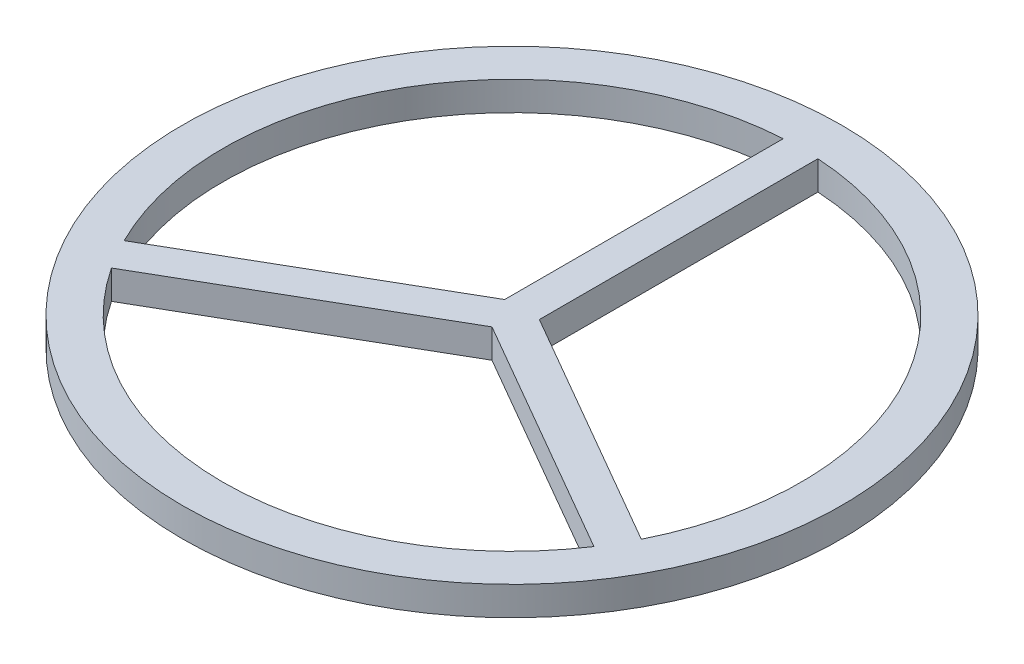
ISO-10303-21;
HEADER;
FILE_DESCRIPTION(('STEP AP214'),'2;1');
FILE_NAME('part.step','',(''),(''),'','','');
FILE_SCHEMA(('AUTOMOTIVE_DESIGN { 1 0 10303 214 1 1 1 1 }'));
ENDSEC;
DATA;
#1=APPLICATION_CONTEXT('core data for automotive mechanical design processes');
#2=APPLICATION_PROTOCOL_DEFINITION('international standard','automotive_design',2000,#1);
#3=PRODUCT_CONTEXT('',#1,'mechanical');
#4=PRODUCT('Part','Part','',(#3));
#5=PRODUCT_RELATED_PRODUCT_CATEGORY('part','',(#4));
#6=PRODUCT_DEFINITION_FORMATION('','',#4);
#7=PRODUCT_DEFINITION_CONTEXT('part definition',#1,'design');
#8=PRODUCT_DEFINITION('design','',#6,#7);
#9=PRODUCT_DEFINITION_SHAPE('','',#8);
#10=(LENGTH_UNIT() NAMED_UNIT(*) SI_UNIT(.MILLI.,.METRE.));
#11=(NAMED_UNIT(*) PLANE_ANGLE_UNIT() SI_UNIT($,.RADIAN.));
#12=(NAMED_UNIT(*) SI_UNIT($,.STERADIAN.) SOLID_ANGLE_UNIT());
#13=UNCERTAINTY_MEASURE_WITH_UNIT(LENGTH_MEASURE(1.E-05),#10,'distance_accuracy_value','');
#14=(GEOMETRIC_REPRESENTATION_CONTEXT(3) GLOBAL_UNCERTAINTY_ASSIGNED_CONTEXT((#13)) GLOBAL_UNIT_ASSIGNED_CONTEXT((#10,
#11,#12)) REPRESENTATION_CONTEXT('',''));
#15=CARTESIAN_POINT('',(0.,0.,0.));
#16=DIRECTION('',(0.,0.,1.));
#17=DIRECTION('',(1.,0.,0.));
#18=AXIS2_PLACEMENT_3D('',#15,#16,#17);
#19=CARTESIAN_POINT('',(0.,2.5,0.));
#20=DIRECTION('',(0.,-1.,0.));
#21=DIRECTION('',(0.,0.,-1.));
#22=AXIS2_PLACEMENT_3D('',#19,#20,#21);
#23=CYLINDRICAL_SURFACE('',#22,25.);
#24=DIRECTION('',(0.,-1.,0.));
#25=VECTOR('',#24,1.);
#26=CARTESIAN_POINT('',(-22.3616288141361,2.5,11.1784416077912));
#27=LINE('',#26,#25);
#28=CARTESIAN_POINT('',(-22.3616288141361,0.,11.1784416077912));
#29=VERTEX_POINT('',#28);
#30=CARTESIAN_POINT('',(-22.3616288141361,2.5,11.1784416077912));
#31=VERTEX_POINT('',#30);
#32=EDGE_CURVE('E11',#29,#31,#27,.F.);
#33=ORIENTED_EDGE('',*,*,#32,.F.);
#34=CARTESIAN_POINT('',(0.,0.,0.));
#35=DIRECTION('',(0.,1.,0.));
#36=DIRECTION('',(0.,0.,1.));
#37=AXIS2_PLACEMENT_3D('',#34,#35,#36);
#38=CIRCLE('',#37,25.);
#39=CARTESIAN_POINT('',(-1.5,0.,-24.9549594269356));
#40=VERTEX_POINT('',#39);
#41=EDGE_CURVE('E153',#40,#29,#38,.T.);
#42=ORIENTED_EDGE('',*,*,#41,.F.);
#43=DIRECTION('',(0.,-1.,0.));
#44=VECTOR('',#43,1.);
#45=CARTESIAN_POINT('',(-1.5,2.5,-24.9549594269356));
#46=LINE('',#45,#44);
#47=CARTESIAN_POINT('',(-1.5,2.5,-24.9549594269356));
#48=VERTEX_POINT('',#47);
#49=EDGE_CURVE('E42',#48,#40,#46,.T.);
#50=ORIENTED_EDGE('',*,*,#49,.F.);
#51=CARTESIAN_POINT('',(0.,2.5,0.));
#52=DIRECTION('',(0.,1.,0.));
#53=DIRECTION('',(0.,0.,1.));
#54=AXIS2_PLACEMENT_3D('',#51,#52,#53);
#55=CIRCLE('',#54,25.);
#56=EDGE_CURVE('E149',#48,#31,#55,.T.);
#57=ORIENTED_EDGE('',*,*,#56,.T.);
#58=EDGE_LOOP('',(#33,#42,#50,#57));
#59=FACE_BOUND('',#58,.T.);
#60=ADVANCED_FACE('F34',(#59),#23,.F.);
#61=DIRECTION('',(0.,-1.,0.));
#62=VECTOR('',#61,1.);
#63=CARTESIAN_POINT('',(1.5,2.5,-24.9549594269356));
#64=LINE('',#63,#62);
#65=CARTESIAN_POINT('',(1.5,0.,-24.9549594269356));
#66=VERTEX_POINT('',#65);
#67=CARTESIAN_POINT('',(1.5,2.5,-24.9549594269356));
#68=VERTEX_POINT('',#67);
#69=EDGE_CURVE('E166',#66,#68,#64,.F.);
#70=ORIENTED_EDGE('',*,*,#69,.F.);
#71=CARTESIAN_POINT('',(22.3616288141361,0.,11.1784416077912));
#72=VERTEX_POINT('',#71);
#73=EDGE_CURVE('E150',#72,#66,#38,.T.);
#74=ORIENTED_EDGE('',*,*,#73,.F.);
#75=DIRECTION('',(0.,-1.,0.));
#76=VECTOR('',#75,1.);
#77=CARTESIAN_POINT('',(22.3616288141361,2.5,11.1784416077912));
#78=LINE('',#77,#76);
#79=CARTESIAN_POINT('',(22.3616288141361,2.5,11.1784416077912));
#80=VERTEX_POINT('',#79);
#81=EDGE_CURVE('E163',#80,#72,#78,.T.);
#82=ORIENTED_EDGE('',*,*,#81,.F.);
#83=EDGE_CURVE('E151',#80,#68,#55,.T.);
#84=ORIENTED_EDGE('',*,*,#83,.T.);
#85=EDGE_LOOP('',(#70,#74,#82,#84));
#86=FACE_BOUND('',#85,.T.);
#87=ADVANCED_FACE('F187',(#86),#23,.F.);
#88=CARTESIAN_POINT('',(0.,2.5,0.));
#89=DIRECTION('',(0.,1.,0.));
#90=DIRECTION('',(0.,0.,1.));
#91=AXIS2_PLACEMENT_3D('',#88,#89,#90);
#92=PLANE('',#91);
#93=ORIENTED_EDGE('',*,*,#56,.F.);
#94=DIRECTION('',(0.,0.,1.));
#95=VECTOR('',#94,1.);
#96=CARTESIAN_POINT('',(-1.5,2.5,-0.866025403784434));
#97=LINE('',#96,#95);
#98=CARTESIAN_POINT('',(-1.5,2.5,-0.866025403784434));
#99=VERTEX_POINT('',#98);
#100=EDGE_CURVE('E135',#48,#99,#97,.T.);
#101=ORIENTED_EDGE('',*,*,#100,.T.);
#102=DIRECTION('',(-0.866025403784436,0.,0.500000000000004));
#103=VECTOR('',#102,1.);
#104=CARTESIAN_POINT('',(-1.5,2.5,-0.866025403784434));
#105=LINE('',#104,#103);
#106=EDGE_CURVE('E122',#99,#31,#105,.T.);
#107=ORIENTED_EDGE('',*,*,#106,.T.);
#108=EDGE_LOOP('',(#93,#101,#107));
#109=FACE_BOUND('',#108,.T.);
#110=ORIENTED_EDGE('',*,*,#83,.F.);
#111=DIRECTION('',(-0.866025403784436,0.,-0.500000000000004));
#112=VECTOR('',#111,1.);
#113=CARTESIAN_POINT('',(1.5,2.5,-0.866025403784434));
#114=LINE('',#113,#112);
#115=CARTESIAN_POINT('',(1.5,2.5,-0.866025403784434));
#116=VERTEX_POINT('',#115);
#117=EDGE_CURVE('E127',#80,#116,#114,.T.);
#118=ORIENTED_EDGE('',*,*,#117,.T.);
#119=DIRECTION('',(0.,0.,-1.));
#120=VECTOR('',#119,1.);
#121=CARTESIAN_POINT('',(1.5,2.5,-0.866025403784434));
#122=LINE('',#121,#120);
#123=EDGE_CURVE('E129',#116,#68,#122,.T.);
#124=ORIENTED_EDGE('',*,*,#123,.T.);
#125=EDGE_LOOP('',(#110,#118,#124));
#126=FACE_BOUND('',#125,.T.);
#127=DIRECTION('',(0.866025403784436,0.,0.500000000000004));
#128=VECTOR('',#127,1.);
#129=CARTESIAN_POINT('',(0.,2.5,1.73205080756888));
#130=LINE('',#129,#128);
#131=CARTESIAN_POINT('',(0.,2.5,1.73205080756888));
#132=VERTEX_POINT('',#131);
#133=CARTESIAN_POINT('',(20.8616288141361,2.5,13.7765178191445));
#134=VERTEX_POINT('',#133);
#135=EDGE_CURVE('E111',#132,#134,#130,.T.);
#136=ORIENTED_EDGE('',*,*,#135,.T.);
#137=CARTESIAN_POINT('',(-20.8616288141361,2.5,13.7765178191445));
#138=VERTEX_POINT('',#137);
#139=EDGE_CURVE('E113',#138,#134,#55,.T.);
#140=ORIENTED_EDGE('',*,*,#139,.F.);
#141=DIRECTION('',(0.866025403784436,0.,-0.500000000000004));
#142=VECTOR('',#141,1.);
#143=CARTESIAN_POINT('',(0.,2.5,1.73205080756888));
#144=LINE('',#143,#142);
#145=EDGE_CURVE('E106',#138,#132,#144,.T.);
#146=ORIENTED_EDGE('',*,*,#145,.T.);
#147=EDGE_LOOP('',(#136,#140,#146));
#148=FACE_BOUND('',#147,.T.);
#149=CARTESIAN_POINT('',(0.,2.5,0.));
#150=DIRECTION('',(0.,1.,0.));
#151=DIRECTION('',(0.,0.,1.));
#152=AXIS2_PLACEMENT_3D('',#149,#150,#151);
#153=CIRCLE('',#152,28.5);
#154=CARTESIAN_POINT('',(0.,2.5,28.5));
#155=VERTEX_POINT('',#154);
#156=EDGE_CURVE('E154',#155,#155,#153,.T.);
#157=ORIENTED_EDGE('',*,*,#156,.T.);
#158=EDGE_LOOP('',(#157));
#159=FACE_BOUND('',#158,.T.);
#160=ADVANCED_FACE('F108',(#109,#126,#148,#159),#92,.T.);
#161=CARTESIAN_POINT('',(0.,0.,0.));
#162=DIRECTION('',(0.,1.,0.));
#163=DIRECTION('',(0.,0.,1.));
#164=AXIS2_PLACEMENT_3D('',#161,#162,#163);
#165=PLANE('',#164);
#166=DIRECTION('',(0.,0.,-1.));
#167=VECTOR('',#166,1.);
#168=CARTESIAN_POINT('',(-1.5,0.,-0.866025403784434));
#169=LINE('',#168,#167);
#170=CARTESIAN_POINT('',(-1.5,0.,-0.866025403784434));
#171=VERTEX_POINT('',#170);
#172=EDGE_CURVE('E57',#171,#40,#169,.T.);
#173=ORIENTED_EDGE('',*,*,#172,.T.);
#174=ORIENTED_EDGE('',*,*,#41,.T.);
#175=DIRECTION('',(0.866025403784436,0.,-0.500000000000004));
#176=VECTOR('',#175,1.);
#177=CARTESIAN_POINT('',(-1.5,0.,-0.866025403784434));
#178=LINE('',#177,#176);
#179=EDGE_CURVE('E147',#29,#171,#178,.T.);
#180=ORIENTED_EDGE('',*,*,#179,.T.);
#181=EDGE_LOOP('',(#173,#174,#180));
#182=FACE_BOUND('',#181,.T.);
#183=DIRECTION('',(0.866025403784436,0.,0.500000000000004));
#184=VECTOR('',#183,1.);
#185=CARTESIAN_POINT('',(1.5,0.,-0.866025403784434));
#186=LINE('',#185,#184);
#187=CARTESIAN_POINT('',(1.5,0.,-0.866025403784434));
#188=VERTEX_POINT('',#187);
#189=EDGE_CURVE('E183',#188,#72,#186,.T.);
#190=ORIENTED_EDGE('',*,*,#189,.T.);
#191=ORIENTED_EDGE('',*,*,#73,.T.);
#192=DIRECTION('',(0.,0.,1.));
#193=VECTOR('',#192,1.);
#194=CARTESIAN_POINT('',(1.5,0.,-0.866025403784434));
#195=LINE('',#194,#193);
#196=EDGE_CURVE('E181',#66,#188,#195,.T.);
#197=ORIENTED_EDGE('',*,*,#196,.T.);
#198=EDGE_LOOP('',(#190,#191,#197));
#199=FACE_BOUND('',#198,.T.);
#200=CARTESIAN_POINT('',(0.,0.,0.));
#201=DIRECTION('',(0.,1.,0.));
#202=DIRECTION('',(0.,0.,1.));
#203=AXIS2_PLACEMENT_3D('',#200,#201,#202);
#204=CIRCLE('',#203,28.5);
#205=CARTESIAN_POINT('',(0.,0.,28.5));
#206=VERTEX_POINT('',#205);
#207=EDGE_CURVE('E158',#206,#206,#204,.T.);
#208=ORIENTED_EDGE('',*,*,#207,.F.);
#209=EDGE_LOOP('',(#208));
#210=FACE_BOUND('',#209,.T.);
#211=CARTESIAN_POINT('',(-20.8616288141361,0.,13.7765178191445));
#212=VERTEX_POINT('',#211);
#213=CARTESIAN_POINT('',(20.8616288141361,0.,13.7765178191445));
#214=VERTEX_POINT('',#213);
#215=EDGE_CURVE('E146',#212,#214,#38,.T.);
#216=ORIENTED_EDGE('',*,*,#215,.T.);
#217=DIRECTION('',(-0.866025403784436,0.,-0.500000000000004));
#218=VECTOR('',#217,1.);
#219=CARTESIAN_POINT('',(0.,0.,1.73205080756888));
#220=LINE('',#219,#218);
#221=CARTESIAN_POINT('',(0.,0.,1.73205080756888));
#222=VERTEX_POINT('',#221);
#223=EDGE_CURVE('E142',#214,#222,#220,.T.);
#224=ORIENTED_EDGE('',*,*,#223,.T.);
#225=DIRECTION('',(-0.866025403784436,0.,0.500000000000004));
#226=VECTOR('',#225,1.);
#227=CARTESIAN_POINT('',(0.,0.,1.73205080756888));
#228=LINE('',#227,#226);
#229=EDGE_CURVE('E49',#222,#212,#228,.T.);
#230=ORIENTED_EDGE('',*,*,#229,.T.);
#231=EDGE_LOOP('',(#216,#224,#230));
#232=FACE_BOUND('',#231,.T.);
#233=ADVANCED_FACE('F179',(#182,#199,#210,#232),#165,.F.);
#234=CARTESIAN_POINT('',(0.,2.5,0.));
#235=DIRECTION('',(0.,-1.,0.));
#236=DIRECTION('',(0.,0.,-1.));
#237=AXIS2_PLACEMENT_3D('',#234,#235,#236);
#238=CYLINDRICAL_SURFACE('',#237,28.5);
#239=ORIENTED_EDGE('',*,*,#156,.F.);
#240=EDGE_LOOP('',(#239));
#241=FACE_BOUND('',#240,.T.);
#242=ORIENTED_EDGE('',*,*,#207,.T.);
#243=EDGE_LOOP('',(#242));
#244=FACE_BOUND('',#243,.T.);
#245=ADVANCED_FACE('F36',(#241,#244),#238,.T.);
#246=DIRECTION('',(0.,-1.,0.));
#247=VECTOR('',#246,1.);
#248=CARTESIAN_POINT('',(20.8616288141361,2.5,13.7765178191445));
#249=LINE('',#248,#247);
#250=EDGE_CURVE('E126',#214,#134,#249,.F.);
#251=ORIENTED_EDGE('',*,*,#250,.F.);
#252=ORIENTED_EDGE('',*,*,#215,.F.);
#253=DIRECTION('',(0.,-1.,0.));
#254=VECTOR('',#253,1.);
#255=CARTESIAN_POINT('',(-20.8616288141361,2.5,13.7765178191445));
#256=LINE('',#255,#254);
#257=EDGE_CURVE('E157',#138,#212,#256,.T.);
#258=ORIENTED_EDGE('',*,*,#257,.F.);
#259=ORIENTED_EDGE('',*,*,#139,.T.);
#260=EDGE_LOOP('',(#251,#252,#258,#259));
#261=FACE_BOUND('',#260,.T.);
#262=ADVANCED_FACE('F212',(#261),#23,.F.);
#263=CARTESIAN_POINT('',(-1.5,-59.2665096702464,-0.866025403784434));
#264=DIRECTION('',(-0.500000000000004,0.,-0.866025403784436));
#265=DIRECTION('',(-0.866025403784436,0.,0.500000000000004));
#266=AXIS2_PLACEMENT_3D('',#263,#264,#265);
#267=PLANE('',#266);
#268=ORIENTED_EDGE('',*,*,#179,.F.);
#269=ORIENTED_EDGE('',*,*,#32,.T.);
#270=ORIENTED_EDGE('',*,*,#106,.F.);
#271=DIRECTION('',(0.,1.,0.));
#272=VECTOR('',#271,1.);
#273=CARTESIAN_POINT('',(-1.5,-59.2665096702464,-0.866025403784434));
#274=LINE('',#273,#272);
#275=EDGE_CURVE('E139',#171,#99,#274,.T.);
#276=ORIENTED_EDGE('',*,*,#275,.F.);
#277=EDGE_LOOP('',(#268,#269,#270,#276));
#278=FACE_BOUND('',#277,.T.);
#279=ADVANCED_FACE('F202',(#278),#267,.T.);
#280=CARTESIAN_POINT('',(-1.5,-59.2665096702464,-0.866025403784434));
#281=DIRECTION('',(-1.,0.,0.));
#282=DIRECTION('',(0.,0.,1.));
#283=AXIS2_PLACEMENT_3D('',#280,#281,#282);
#284=PLANE('',#283);
#285=ORIENTED_EDGE('',*,*,#100,.F.);
#286=ORIENTED_EDGE('',*,*,#49,.T.);
#287=ORIENTED_EDGE('',*,*,#172,.F.);
#288=ORIENTED_EDGE('',*,*,#275,.T.);
#289=EDGE_LOOP('',(#285,#286,#287,#288));
#290=FACE_BOUND('',#289,.T.);
#291=ADVANCED_FACE('F170',(#290),#284,.T.);
#292=CARTESIAN_POINT('',(1.5,-59.2665096702464,-0.866025403784434));
#293=DIRECTION('',(1.,0.,0.));
#294=DIRECTION('',(0.,0.,-1.));
#295=AXIS2_PLACEMENT_3D('',#292,#293,#294);
#296=PLANE('',#295);
#297=ORIENTED_EDGE('',*,*,#196,.F.);
#298=ORIENTED_EDGE('',*,*,#69,.T.);
#299=ORIENTED_EDGE('',*,*,#123,.F.);
#300=DIRECTION('',(0.,1.,0.));
#301=VECTOR('',#300,1.);
#302=CARTESIAN_POINT('',(1.5,-59.2665096702464,-0.866025403784434));
#303=LINE('',#302,#301);
#304=EDGE_CURVE('E121',#188,#116,#303,.T.);
#305=ORIENTED_EDGE('',*,*,#304,.F.);
#306=EDGE_LOOP('',(#297,#298,#299,#305));
#307=FACE_BOUND('',#306,.T.);
#308=ADVANCED_FACE('F192',(#307),#296,.T.);
#309=CARTESIAN_POINT('',(1.5,-59.2665096702464,-0.866025403784434));
#310=DIRECTION('',(0.500000000000004,0.,-0.866025403784436));
#311=DIRECTION('',(-0.866025403784436,0.,-0.500000000000004));
#312=AXIS2_PLACEMENT_3D('',#309,#310,#311);
#313=PLANE('',#312);
#314=ORIENTED_EDGE('',*,*,#117,.F.);
#315=ORIENTED_EDGE('',*,*,#81,.T.);
#316=ORIENTED_EDGE('',*,*,#189,.F.);
#317=ORIENTED_EDGE('',*,*,#304,.T.);
#318=EDGE_LOOP('',(#314,#315,#316,#317));
#319=FACE_BOUND('',#318,.T.);
#320=ADVANCED_FACE('F196',(#319),#313,.T.);
#321=CARTESIAN_POINT('',(0.,-59.2665096702464,1.73205080756888));
#322=DIRECTION('',(-0.500000000000004,0.,0.866025403784436));
#323=DIRECTION('',(0.866025403784436,0.,0.500000000000004));
#324=AXIS2_PLACEMENT_3D('',#321,#322,#323);
#325=PLANE('',#324);
#326=ORIENTED_EDGE('',*,*,#223,.F.);
#327=ORIENTED_EDGE('',*,*,#250,.T.);
#328=ORIENTED_EDGE('',*,*,#135,.F.);
#329=DIRECTION('',(0.,1.,0.));
#330=VECTOR('',#329,1.);
#331=CARTESIAN_POINT('',(0.,-59.2665096702464,1.73205080756888));
#332=LINE('',#331,#330);
#333=EDGE_CURVE('E118',#222,#132,#332,.T.);
#334=ORIENTED_EDGE('',*,*,#333,.F.);
#335=EDGE_LOOP('',(#326,#327,#328,#334));
#336=FACE_BOUND('',#335,.T.);
#337=ADVANCED_FACE('F124',(#336),#325,.T.);
#338=CARTESIAN_POINT('',(0.,-59.2665096702464,1.73205080756888));
#339=DIRECTION('',(0.500000000000004,0.,0.866025403784436));
#340=DIRECTION('',(0.866025403784436,0.,-0.500000000000004));
#341=AXIS2_PLACEMENT_3D('',#338,#339,#340);
#342=PLANE('',#341);
#343=ORIENTED_EDGE('',*,*,#145,.F.);
#344=ORIENTED_EDGE('',*,*,#257,.T.);
#345=ORIENTED_EDGE('',*,*,#229,.F.);
#346=ORIENTED_EDGE('',*,*,#333,.T.);
#347=EDGE_LOOP('',(#343,#344,#345,#346));
#348=FACE_BOUND('',#347,.T.);
#349=ADVANCED_FACE('F119',(#348),#342,.T.);
#350=CLOSED_SHELL('',(#60,#87,#160,#233,#245,#262,#279,#291,#308,#320,#337,#349));
#351=MANIFOLD_SOLID_BREP('B2',#350);
#352=ADVANCED_BREP_SHAPE_REPRESENTATION('',(#18,#351),#14);
#353=SHAPE_DEFINITION_REPRESENTATION(#9,#352);
ENDSEC;
END-ISO-10303-21;
